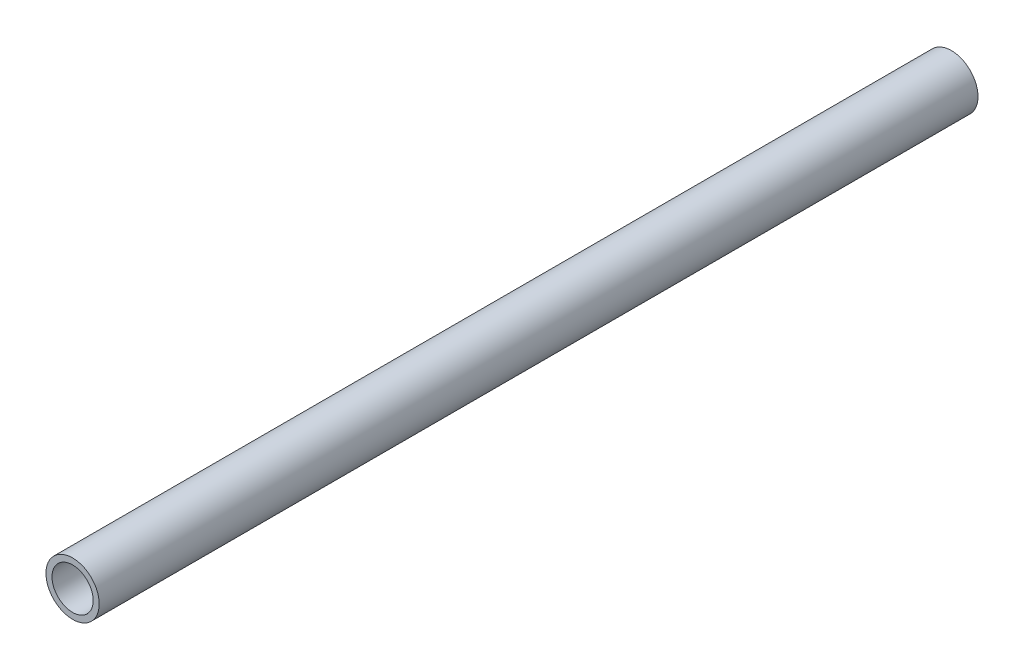
ISO-10303-21;
HEADER;
FILE_DESCRIPTION(('STEP AP214'),'2;1');
FILE_NAME('part.step','',(''),(''),'','','');
FILE_SCHEMA(('AUTOMOTIVE_DESIGN { 1 0 10303 214 1 1 1 1 }'));
ENDSEC;
DATA;
#1=APPLICATION_CONTEXT('core data for automotive mechanical design processes');
#2=APPLICATION_PROTOCOL_DEFINITION('international standard','automotive_design',2000,#1);
#3=PRODUCT_CONTEXT('',#1,'mechanical');
#4=PRODUCT('Part','Part','',(#3));
#5=PRODUCT_RELATED_PRODUCT_CATEGORY('part','',(#4));
#6=PRODUCT_DEFINITION_FORMATION('','',#4);
#7=PRODUCT_DEFINITION_CONTEXT('part definition',#1,'design');
#8=PRODUCT_DEFINITION('design','',#6,#7);
#9=PRODUCT_DEFINITION_SHAPE('','',#8);
#10=(LENGTH_UNIT() NAMED_UNIT(*) SI_UNIT(.MILLI.,.METRE.));
#11=(NAMED_UNIT(*) PLANE_ANGLE_UNIT() SI_UNIT($,.RADIAN.));
#12=(NAMED_UNIT(*) SI_UNIT($,.STERADIAN.) SOLID_ANGLE_UNIT());
#13=UNCERTAINTY_MEASURE_WITH_UNIT(LENGTH_MEASURE(1.E-05),#10,'distance_accuracy_value','');
#14=(GEOMETRIC_REPRESENTATION_CONTEXT(3) GLOBAL_UNCERTAINTY_ASSIGNED_CONTEXT((#13)) GLOBAL_UNIT_ASSIGNED_CONTEXT((#10,
#11,#12)) REPRESENTATION_CONTEXT('',''));
#15=CARTESIAN_POINT('',(0.,0.,0.));
#16=DIRECTION('',(0.,0.,1.));
#17=DIRECTION('',(1.,0.,0.));
#18=AXIS2_PLACEMENT_3D('',#15,#16,#17);
#19=CARTESIAN_POINT('',(0.,0.,101.6));
#20=DIRECTION('',(0.,0.,1.));
#21=DIRECTION('',(1.,0.,0.));
#22=AXIS2_PLACEMENT_3D('',#19,#20,#21);
#23=PLANE('',#22);
#24=CARTESIAN_POINT('',(0.,0.,101.6));
#25=DIRECTION('',(0.,0.,1.));
#26=DIRECTION('',(1.,0.,0.));
#27=AXIS2_PLACEMENT_3D('',#24,#25,#26);
#28=CIRCLE('',#27,6.1595);
#29=CARTESIAN_POINT('',(6.1595,0.,101.6));
#30=VERTEX_POINT('',#29);
#31=EDGE_CURVE('E10',#30,#30,#28,.T.);
#32=ORIENTED_EDGE('',*,*,#31,.T.);
#33=EDGE_LOOP('',(#32));
#34=FACE_BOUND('',#33,.T.);
#35=CARTESIAN_POINT('',(0.,0.,101.6));
#36=DIRECTION('',(0.,0.,1.));
#37=DIRECTION('',(1.,0.,0.));
#38=AXIS2_PLACEMENT_3D('',#35,#36,#37);
#39=CIRCLE('',#38,4.7625);
#40=CARTESIAN_POINT('',(4.7625,0.,101.6));
#41=VERTEX_POINT('',#40);
#42=EDGE_CURVE('E40',#41,#41,#39,.T.);
#43=ORIENTED_EDGE('',*,*,#42,.F.);
#44=EDGE_LOOP('',(#43));
#45=FACE_BOUND('',#44,.T.);
#46=ADVANCED_FACE('F33',(#34,#45),#23,.T.);
#47=CARTESIAN_POINT('',(0.,0.,101.6));
#48=DIRECTION('',(0.,0.,-1.));
#49=DIRECTION('',(-1.,0.,0.));
#50=AXIS2_PLACEMENT_3D('',#47,#48,#49);
#51=CYLINDRICAL_SURFACE('',#50,6.1595);
#52=ORIENTED_EDGE('',*,*,#31,.F.);
#53=EDGE_LOOP('',(#52));
#54=FACE_BOUND('',#53,.T.);
#55=CARTESIAN_POINT('',(0.,0.,-101.6));
#56=DIRECTION('',(0.,0.,1.));
#57=DIRECTION('',(1.,0.,0.));
#58=AXIS2_PLACEMENT_3D('',#55,#56,#57);
#59=CIRCLE('',#58,6.1595);
#60=CARTESIAN_POINT('',(6.1595,0.,-101.6));
#61=VERTEX_POINT('',#60);
#62=EDGE_CURVE('E44',#61,#61,#59,.T.);
#63=ORIENTED_EDGE('',*,*,#62,.T.);
#64=EDGE_LOOP('',(#63));
#65=FACE_BOUND('',#64,.T.);
#66=ADVANCED_FACE('F35',(#54,#65),#51,.T.);
#67=CARTESIAN_POINT('',(0.,0.,101.6));
#68=DIRECTION('',(0.,0.,-1.));
#69=DIRECTION('',(-1.,0.,0.));
#70=AXIS2_PLACEMENT_3D('',#67,#68,#69);
#71=CYLINDRICAL_SURFACE('',#70,4.7625);
#72=ORIENTED_EDGE('',*,*,#42,.T.);
#73=EDGE_LOOP('',(#72));
#74=FACE_BOUND('',#73,.T.);
#75=CARTESIAN_POINT('',(0.,0.,-101.6));
#76=DIRECTION('',(0.,0.,1.));
#77=DIRECTION('',(1.,0.,0.));
#78=AXIS2_PLACEMENT_3D('',#75,#76,#77);
#79=CIRCLE('',#78,4.7625);
#80=CARTESIAN_POINT('',(4.7625,0.,-101.6));
#81=VERTEX_POINT('',#80);
#82=EDGE_CURVE('E48',#81,#81,#79,.T.);
#83=ORIENTED_EDGE('',*,*,#82,.F.);
#84=EDGE_LOOP('',(#83));
#85=FACE_BOUND('',#84,.T.);
#86=ADVANCED_FACE('F57',(#74,#85),#71,.F.);
#87=CARTESIAN_POINT('',(0.,0.,-101.6));
#88=DIRECTION('',(0.,0.,1.));
#89=DIRECTION('',(1.,0.,0.));
#90=AXIS2_PLACEMENT_3D('',#87,#88,#89);
#91=PLANE('',#90);
#92=ORIENTED_EDGE('',*,*,#82,.T.);
#93=EDGE_LOOP('',(#92));
#94=FACE_BOUND('',#93,.T.);
#95=ORIENTED_EDGE('',*,*,#62,.F.);
#96=EDGE_LOOP('',(#95));
#97=FACE_BOUND('',#96,.T.);
#98=ADVANCED_FACE('F54',(#94,#97),#91,.F.);
#99=CLOSED_SHELL('',(#46,#66,#86,#98));
#100=MANIFOLD_SOLID_BREP('B2',#99);
#101=ADVANCED_BREP_SHAPE_REPRESENTATION('',(#18,#100),#14);
#102=SHAPE_DEFINITION_REPRESENTATION(#9,#101);
ENDSEC;
END-ISO-10303-21;
